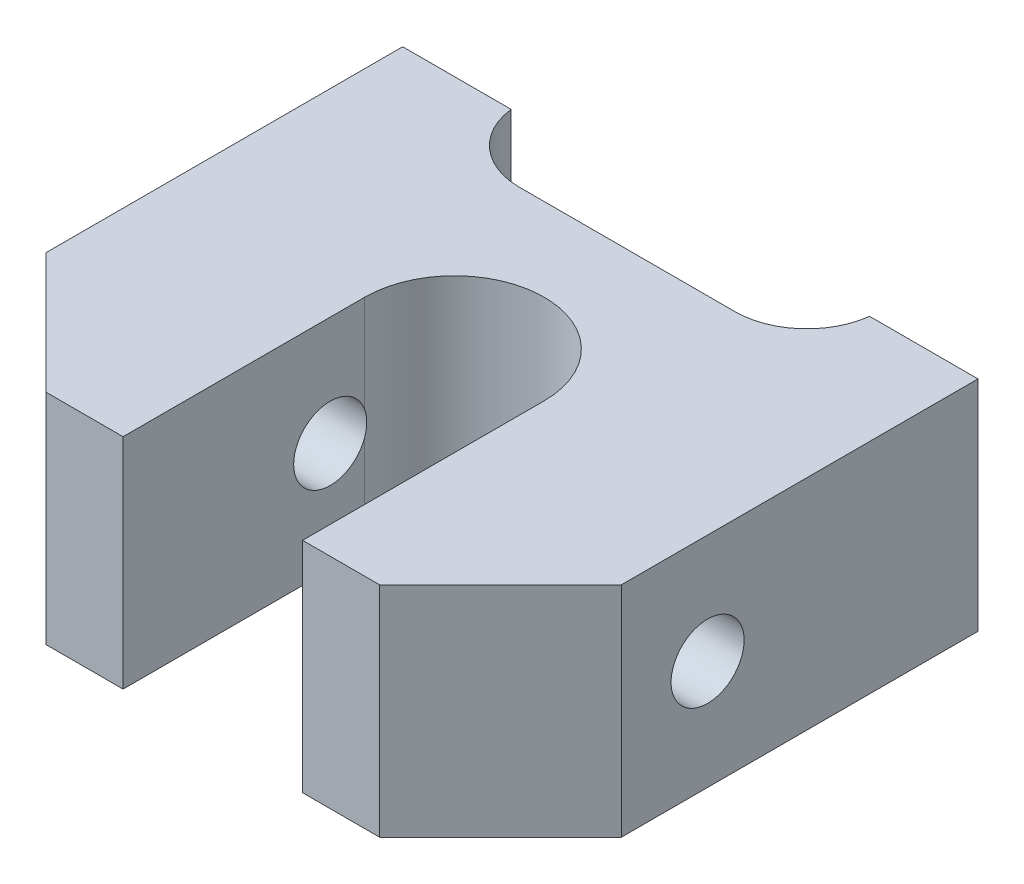
ISO-10303-21;
HEADER;
FILE_DESCRIPTION(('STEP AP214'),'2;1');
FILE_NAME('part.step','',(''),(''),'','','');
FILE_SCHEMA(('AUTOMOTIVE_DESIGN { 1 0 10303 214 1 1 1 1 }'));
ENDSEC;
DATA;
#1=APPLICATION_CONTEXT('core data for automotive mechanical design processes');
#2=APPLICATION_PROTOCOL_DEFINITION('international standard','automotive_design',2000,#1);
#3=PRODUCT_CONTEXT('',#1,'mechanical');
#4=PRODUCT('Part','Part','',(#3));
#5=PRODUCT_RELATED_PRODUCT_CATEGORY('part','',(#4));
#6=PRODUCT_DEFINITION_FORMATION('','',#4);
#7=PRODUCT_DEFINITION_CONTEXT('part definition',#1,'design');
#8=PRODUCT_DEFINITION('design','',#6,#7);
#9=PRODUCT_DEFINITION_SHAPE('','',#8);
#10=(LENGTH_UNIT() NAMED_UNIT(*) SI_UNIT(.MILLI.,.METRE.));
#11=(NAMED_UNIT(*) PLANE_ANGLE_UNIT() SI_UNIT($,.RADIAN.));
#12=(NAMED_UNIT(*) SI_UNIT($,.STERADIAN.) SOLID_ANGLE_UNIT());
#13=UNCERTAINTY_MEASURE_WITH_UNIT(LENGTH_MEASURE(1.E-05),#10,'distance_accuracy_value','');
#14=(GEOMETRIC_REPRESENTATION_CONTEXT(3) GLOBAL_UNCERTAINTY_ASSIGNED_CONTEXT((#13)) GLOBAL_UNIT_ASSIGNED_CONTEXT((#10,
#11,#12)) REPRESENTATION_CONTEXT('',''));
#15=CARTESIAN_POINT('',(0.,0.,0.));
#16=DIRECTION('',(0.,0.,1.));
#17=DIRECTION('',(1.,0.,0.));
#18=AXIS2_PLACEMENT_3D('',#15,#16,#17);
#19=CARTESIAN_POINT('',(34.3914499258173,-4.826,1.397));
#20=DIRECTION('',(1.,0.,0.));
#21=DIRECTION('',(0.,0.,-1.));
#22=AXIS2_PLACEMENT_3D('',#19,#20,#21);
#23=CYLINDRICAL_SURFACE('',#22,1.6129);
#24=CARTESIAN_POINT('',(3.96240000000001,-5.3540818213118,-0.127000000000003));
#25=CARTESIAN_POINT('',(3.96239606872544,-5.31062926964589,-0.142057415175625));
#26=CARTESIAN_POINT('',(3.96231466852501,-5.26655138224218,-0.155247680248759));
#27=CARTESIAN_POINT('',(3.9620908942501,-5.17743372511795,-0.177818873185899));
#28=CARTESIAN_POINT('',(3.96194852373047,-5.13239401162195,-0.187200023077449));
#29=CARTESIAN_POINT('',(3.96157795553437,-4.99881392418985,-0.209100450831656));
#30=CARTESIAN_POINT('',(3.96139554733492,-4.90933154980217,-0.21622711451484));
#31=CARTESIAN_POINT('',(3.96141000916451,-4.7324132038705,-0.215557179312041));
#32=CARTESIAN_POINT('',(3.96159857416771,-4.64497577305173,-0.208087378660905));
#33=CARTESIAN_POINT('',(3.96196423721747,-4.51447114546186,-0.186167779431552));
#34=CARTESIAN_POINT('',(3.96210239578767,-4.47048626860336,-0.176872451525207));
#35=CARTESIAN_POINT('',(3.96231846253592,-4.38344081623891,-0.154645947399195));
#36=CARTESIAN_POINT('',(3.96239636558582,-4.34038031970714,-0.141714461845504));
#37=CARTESIAN_POINT('',(3.96240000000001,-4.2979181786882,-0.127000000000005));
#38=B_SPLINE_CURVE_WITH_KNOTS('',3,(#24,#25,#26,#27,#28,#29,#30,#31,#32,#33,#34,#35,#36,#37),
.UNSPECIFIED.,.F.,.F.,(4,2,2,2,2,2,4),(0.,0.137879884792329,0.275751731621238,0.543728487271669,
0.805774245454699,0.940505245515592,1.07524771083797),.UNSPECIFIED.);
#39=CARTESIAN_POINT('',(3.96240000000001,-5.3540818213118,-0.127000000000003));
#40=VERTEX_POINT('',#39);
#41=CARTESIAN_POINT('',(3.96240000000001,-4.2979181786882,-0.127000000000004));
#42=VERTEX_POINT('',#41);
#43=EDGE_CURVE('E21',#40,#42,#38,.T.);
#44=ORIENTED_EDGE('',*,*,#43,.F.);
#45=CARTESIAN_POINT('',(3.9624,-4.826,1.397));
#46=DIRECTION('',(1.,0.,0.));
#47=DIRECTION('',(0.,0.,-1.));
#48=AXIS2_PLACEMENT_3D('',#45,#46,#47);
#49=CIRCLE('',#48,1.6129);
#50=EDGE_CURVE('E104',#42,#40,#49,.T.);
#51=ORIENTED_EDGE('',*,*,#50,.F.);
#52=EDGE_LOOP('',(#44,#51));
#53=FACE_BOUND('',#52,.T.);
#54=CARTESIAN_POINT('',(12.7,-4.826,1.397));
#55=DIRECTION('',(1.,0.,0.));
#56=DIRECTION('',(0.,0.,-1.));
#57=AXIS2_PLACEMENT_3D('',#54,#55,#56);
#58=CIRCLE('',#57,1.6129);
#59=CARTESIAN_POINT('',(12.7,-4.826,-0.2159));
#60=VERTEX_POINT('',#59);
#61=EDGE_CURVE('E155',#60,#60,#58,.T.);
#62=ORIENTED_EDGE('',*,*,#61,.T.);
#63=EDGE_LOOP('',(#62));
#64=FACE_BOUND('',#63,.T.);
#65=ADVANCED_FACE('F17',(#53,#64),#23,.F.);
#66=CARTESIAN_POINT('',(-34.3914499258173,-4.826,1.397));
#67=DIRECTION('',(-1.,0.,0.));
#68=DIRECTION('',(0.,0.,1.));
#69=AXIS2_PLACEMENT_3D('',#66,#67,#68);
#70=CYLINDRICAL_SURFACE('',#69,1.6129);
#71=CARTESIAN_POINT('',(-3.9624,-4.826,1.397));
#72=DIRECTION('',(-1.,0.,0.));
#73=DIRECTION('',(0.,0.,1.));
#74=AXIS2_PLACEMENT_3D('',#71,#72,#73);
#75=CIRCLE('',#74,1.6129);
#76=CARTESIAN_POINT('',(-3.9624,-5.3540818213118,-0.127000000000004));
#77=VERTEX_POINT('',#76);
#78=CARTESIAN_POINT('',(-3.9624,-4.2979181786882,-0.127000000000004));
#79=VERTEX_POINT('',#78);
#80=EDGE_CURVE('E224',#77,#79,#75,.T.);
#81=ORIENTED_EDGE('',*,*,#80,.F.);
#82=CARTESIAN_POINT('',(-3.96239999999999,-5.3540818213118,-0.127000000000003));
#83=CARTESIAN_POINT('',(-3.96239606872543,-5.31062926964589,-0.142057415175625));
#84=CARTESIAN_POINT('',(-3.962314668525,-5.26655138224217,-0.155247680248759));
#85=CARTESIAN_POINT('',(-3.96209089425008,-5.17743372511795,-0.177818873185899));
#86=CARTESIAN_POINT('',(-3.96194852373046,-5.13239401162195,-0.18720002307745));
#87=CARTESIAN_POINT('',(-3.96157795553436,-4.99881392418985,-0.209100450831656));
#88=CARTESIAN_POINT('',(-3.96139554733491,-4.90933154980217,-0.21622711451484));
#89=CARTESIAN_POINT('',(-3.9614100091645,-4.7324132038705,-0.215557179312041));
#90=CARTESIAN_POINT('',(-3.96159857416769,-4.64497577305173,-0.208087378660905));
#91=CARTESIAN_POINT('',(-3.96196423721745,-4.51447114546186,-0.186167779431552));
#92=CARTESIAN_POINT('',(-3.96210239578765,-4.47048626860336,-0.176872451525207));
#93=CARTESIAN_POINT('',(-3.9623184625359,-4.38344081623891,-0.154645947399195));
#94=CARTESIAN_POINT('',(-3.96239636558581,-4.34038031970714,-0.141714461845504));
#95=CARTESIAN_POINT('',(-3.96239999999999,-4.2979181786882,-0.127000000000005));
#96=B_SPLINE_CURVE_WITH_KNOTS('',3,(#82,#83,#84,#85,#86,#87,#88,#89,#90,#91,#92,#93,#94,#95),
.UNSPECIFIED.,.F.,.F.,(4,2,2,2,2,2,4),(0.,0.137879884792328,0.275751731621238,0.543728487271668,
0.805774245454698,0.940505245515591,1.07524771083797),.UNSPECIFIED.);
#97=EDGE_CURVE('E117',#77,#79,#96,.T.);
#98=ORIENTED_EDGE('',*,*,#97,.T.);
#99=EDGE_LOOP('',(#81,#98));
#100=FACE_BOUND('',#99,.T.);
#101=CARTESIAN_POINT('',(-12.7,-4.826,1.397));
#102=DIRECTION('',(-1.,0.,0.));
#103=DIRECTION('',(0.,0.,1.));
#104=AXIS2_PLACEMENT_3D('',#101,#102,#103);
#105=CIRCLE('',#104,1.6129);
#106=CARTESIAN_POINT('',(-12.7,-4.826,3.0099));
#107=VERTEX_POINT('',#106);
#108=EDGE_CURVE('E173',#107,#107,#105,.T.);
#109=ORIENTED_EDGE('',*,*,#108,.T.);
#110=EDGE_LOOP('',(#109));
#111=FACE_BOUND('',#110,.T.);
#112=ADVANCED_FACE('F230',(#100,#111),#70,.F.);
#113=CARTESIAN_POINT('',(-12.7,0.,-10.541));
#114=DIRECTION('',(0.,-1.,0.));
#115=DIRECTION('',(0.,0.,-1.));
#116=AXIS2_PLACEMENT_3D('',#113,#114,#115);
#117=PLANE('',#116);
#118=DIRECTION('',(-0.707106781186548,0.,0.707106781186547));
#119=VECTOR('',#118,1.);
#120=CARTESIAN_POINT('',(7.366,0.,10.541));
#121=LINE('',#120,#119);
#122=CARTESIAN_POINT('',(7.366,0.,10.541));
#123=VERTEX_POINT('',#122);
#124=CARTESIAN_POINT('',(12.7,0.,5.207));
#125=VERTEX_POINT('',#124);
#126=EDGE_CURVE('E145',#123,#125,#121,.F.);
#127=ORIENTED_EDGE('',*,*,#126,.T.);
#128=DIRECTION('',(0.,0.,1.));
#129=VECTOR('',#128,1.);
#130=CARTESIAN_POINT('',(12.7,0.,-10.541));
#131=LINE('',#130,#129);
#132=CARTESIAN_POINT('',(12.7,0.,-10.541));
#133=VERTEX_POINT('',#132);
#134=EDGE_CURVE('E103',#125,#133,#131,.F.);
#135=ORIENTED_EDGE('',*,*,#134,.T.);
#136=DIRECTION('',(1.,0.,0.));
#137=VECTOR('',#136,1.);
#138=CARTESIAN_POINT('',(-12.7,0.,-10.541));
#139=LINE('',#138,#137);
#140=CARTESIAN_POINT('',(7.91455710608167,0.,-10.541));
#141=VERTEX_POINT('',#140);
#142=EDGE_CURVE('E148',#133,#141,#139,.F.);
#143=ORIENTED_EDGE('',*,*,#142,.T.);
#144=CARTESIAN_POINT('',(4.7625,0.,-10.922));
#145=DIRECTION('',(0.,1.,0.));
#146=DIRECTION('',(0.,0.,1.));
#147=AXIS2_PLACEMENT_3D('',#144,#145,#146);
#148=CIRCLE('',#147,3.175);
#149=CARTESIAN_POINT('',(4.7625,0.,-7.747));
#150=VERTEX_POINT('',#149);
#151=EDGE_CURVE('E217',#141,#150,#148,.F.);
#152=ORIENTED_EDGE('',*,*,#151,.T.);
#153=DIRECTION('',(-1.,0.,0.));
#154=VECTOR('',#153,1.);
#155=CARTESIAN_POINT('',(-4.7625,0.,-7.747));
#156=LINE('',#155,#154);
#157=CARTESIAN_POINT('',(-4.7625,0.,-7.747));
#158=VERTEX_POINT('',#157);
#159=EDGE_CURVE('E158',#158,#150,#156,.F.);
#160=ORIENTED_EDGE('',*,*,#159,.F.);
#161=CARTESIAN_POINT('',(-4.7625,0.,-10.922));
#162=DIRECTION('',(0.,1.,0.));
#163=DIRECTION('',(0.,0.,1.));
#164=AXIS2_PLACEMENT_3D('',#161,#162,#163);
#165=CIRCLE('',#164,3.175);
#166=CARTESIAN_POINT('',(-7.91455710608168,0.,-10.541));
#167=VERTEX_POINT('',#166);
#168=EDGE_CURVE('E220',#158,#167,#165,.F.);
#169=ORIENTED_EDGE('',*,*,#168,.T.);
#170=DIRECTION('',(1.,0.,0.));
#171=VECTOR('',#170,1.);
#172=CARTESIAN_POINT('',(-12.7,0.,-10.541));
#173=LINE('',#172,#171);
#174=CARTESIAN_POINT('',(-12.7,0.,-10.541));
#175=VERTEX_POINT('',#174);
#176=EDGE_CURVE('E163',#167,#175,#173,.F.);
#177=ORIENTED_EDGE('',*,*,#176,.T.);
#178=DIRECTION('',(0.,0.,-1.));
#179=VECTOR('',#178,1.);
#180=CARTESIAN_POINT('',(-12.7,0.,10.541));
#181=LINE('',#180,#179);
#182=CARTESIAN_POINT('',(-12.7,0.,5.207));
#183=VERTEX_POINT('',#182);
#184=EDGE_CURVE('E170',#175,#183,#181,.F.);
#185=ORIENTED_EDGE('',*,*,#184,.T.);
#186=DIRECTION('',(-0.707106781186548,0.,-0.707106781186548));
#187=VECTOR('',#186,1.);
#188=CARTESIAN_POINT('',(-12.7,0.,5.207));
#189=LINE('',#188,#187);
#190=CARTESIAN_POINT('',(-7.366,0.,10.541));
#191=VERTEX_POINT('',#190);
#192=EDGE_CURVE('E176',#183,#191,#189,.F.);
#193=ORIENTED_EDGE('',*,*,#192,.T.);
#194=DIRECTION('',(-1.,0.,0.));
#195=VECTOR('',#194,1.);
#196=CARTESIAN_POINT('',(12.7,0.,10.541));
#197=LINE('',#196,#195);
#198=CARTESIAN_POINT('',(-3.9624,0.,10.541));
#199=VERTEX_POINT('',#198);
#200=EDGE_CURVE('E180',#191,#199,#197,.F.);
#201=ORIENTED_EDGE('',*,*,#200,.T.);
#202=DIRECTION('',(0.,0.,-1.));
#203=VECTOR('',#202,1.);
#204=CARTESIAN_POINT('',(-3.9624,0.,-0.127000000000004));
#205=LINE('',#204,#203);
#206=CARTESIAN_POINT('',(-3.9624,0.,-0.127000000000004));
#207=VERTEX_POINT('',#206);
#208=EDGE_CURVE('E188',#207,#199,#205,.F.);
#209=ORIENTED_EDGE('',*,*,#208,.F.);
#210=CARTESIAN_POINT('',(0.,0.,-0.127000000000004));
#211=DIRECTION('',(0.,1.,0.));
#212=DIRECTION('',(0.,0.,1.));
#213=AXIS2_PLACEMENT_3D('',#210,#211,#212);
#214=CIRCLE('',#213,3.9624);
#215=CARTESIAN_POINT('',(3.9624,0.,-0.127000000000004));
#216=VERTEX_POINT('',#215);
#217=EDGE_CURVE('E115',#207,#216,#214,.F.);
#218=ORIENTED_EDGE('',*,*,#217,.T.);
#219=DIRECTION('',(0.,0.,1.));
#220=VECTOR('',#219,1.);
#221=CARTESIAN_POINT('',(3.9624,0.,-0.127000000000004));
#222=LINE('',#221,#220);
#223=CARTESIAN_POINT('',(3.9624,0.,10.541));
#224=VERTEX_POINT('',#223);
#225=EDGE_CURVE('E114',#224,#216,#222,.F.);
#226=ORIENTED_EDGE('',*,*,#225,.F.);
#227=DIRECTION('',(-1.,0.,0.));
#228=VECTOR('',#227,1.);
#229=CARTESIAN_POINT('',(12.7,0.,10.541));
#230=LINE('',#229,#228);
#231=EDGE_CURVE('E134',#224,#123,#230,.F.);
#232=ORIENTED_EDGE('',*,*,#231,.T.);
#233=EDGE_LOOP('',(#127,#135,#143,#152,#160,#169,#177,#185,#193,#201,#209,#218,#226,#232));
#234=FACE_BOUND('',#233,.T.);
#235=ADVANCED_FACE('F252',(#234),#117,.F.);
#236=CARTESIAN_POINT('',(12.7,-9.652,-10.541));
#237=DIRECTION('',(-1.,0.,0.));
#238=DIRECTION('',(0.,0.,1.));
#239=AXIS2_PLACEMENT_3D('',#236,#237,#238);
#240=PLANE('',#239);
#241=ORIENTED_EDGE('',*,*,#61,.F.);
#242=EDGE_LOOP('',(#241));
#243=FACE_BOUND('',#242,.T.);
#244=DIRECTION('',(0.,1.,0.));
#245=VECTOR('',#244,1.);
#246=CARTESIAN_POINT('',(12.7,-9.652,5.207));
#247=LINE('',#246,#245);
#248=CARTESIAN_POINT('',(12.7,-9.652,5.207));
#249=VERTEX_POINT('',#248);
#250=EDGE_CURVE('E142',#125,#249,#247,.F.);
#251=ORIENTED_EDGE('',*,*,#250,.T.);
#252=DIRECTION('',(0.,0.,-1.));
#253=VECTOR('',#252,1.);
#254=CARTESIAN_POINT('',(12.7,-9.652,-10.541));
#255=LINE('',#254,#253);
#256=CARTESIAN_POINT('',(12.7,-9.652,-10.541));
#257=VERTEX_POINT('',#256);
#258=EDGE_CURVE('E139',#257,#249,#255,.F.);
#259=ORIENTED_EDGE('',*,*,#258,.F.);
#260=DIRECTION('',(0.,1.,0.));
#261=VECTOR('',#260,1.);
#262=CARTESIAN_POINT('',(12.7,-9.652,-10.541));
#263=LINE('',#262,#261);
#264=EDGE_CURVE('E150',#257,#133,#263,.T.);
#265=ORIENTED_EDGE('',*,*,#264,.T.);
#266=ORIENTED_EDGE('',*,*,#134,.F.);
#267=EDGE_LOOP('',(#251,#259,#265,#266));
#268=FACE_BOUND('',#267,.T.);
#269=ADVANCED_FACE('F249',(#243,#268),#240,.F.);
#270=CARTESIAN_POINT('',(7.366,-9.652,10.541));
#271=DIRECTION('',(-0.707106781186547,0.,-0.707106781186548));
#272=DIRECTION('',(-0.707106781186548,0.,0.707106781186547));
#273=AXIS2_PLACEMENT_3D('',#270,#271,#272);
#274=PLANE('',#273);
#275=ORIENTED_EDGE('',*,*,#250,.F.);
#276=ORIENTED_EDGE('',*,*,#126,.F.);
#277=DIRECTION('',(0.,1.,0.));
#278=VECTOR('',#277,1.);
#279=CARTESIAN_POINT('',(7.366,-9.652,10.541));
#280=LINE('',#279,#278);
#281=CARTESIAN_POINT('',(7.366,-9.652,10.541));
#282=VERTEX_POINT('',#281);
#283=EDGE_CURVE('E108',#123,#282,#280,.F.);
#284=ORIENTED_EDGE('',*,*,#283,.T.);
#285=DIRECTION('',(-0.707106781186547,0.,0.707106781186548));
#286=VECTOR('',#285,1.);
#287=CARTESIAN_POINT('',(12.7,-9.652,5.207));
#288=LINE('',#287,#286);
#289=EDGE_CURVE('E129',#249,#282,#288,.T.);
#290=ORIENTED_EDGE('',*,*,#289,.F.);
#291=EDGE_LOOP('',(#275,#276,#284,#290));
#292=FACE_BOUND('',#291,.T.);
#293=ADVANCED_FACE('F245',(#292),#274,.F.);
#294=CARTESIAN_POINT('',(12.7,-9.652,10.541));
#295=DIRECTION('',(0.,0.,-1.));
#296=DIRECTION('',(-1.,0.,0.));
#297=AXIS2_PLACEMENT_3D('',#294,#295,#296);
#298=PLANE('',#297);
#299=ORIENTED_EDGE('',*,*,#283,.F.);
#300=ORIENTED_EDGE('',*,*,#231,.F.);
#301=DIRECTION('',(0.,1.,0.));
#302=VECTOR('',#301,1.);
#303=CARTESIAN_POINT('',(3.9624,101.473,10.541));
#304=LINE('',#303,#302);
#305=CARTESIAN_POINT('',(3.9624,-9.652,10.541));
#306=VERTEX_POINT('',#305);
#307=EDGE_CURVE('E107',#306,#224,#304,.T.);
#308=ORIENTED_EDGE('',*,*,#307,.F.);
#309=DIRECTION('',(1.,0.,0.));
#310=VECTOR('',#309,1.);
#311=CARTESIAN_POINT('',(-12.7,-9.652,10.541));
#312=LINE('',#311,#310);
#313=EDGE_CURVE('E125',#282,#306,#312,.F.);
#314=ORIENTED_EDGE('',*,*,#313,.F.);
#315=EDGE_LOOP('',(#299,#300,#308,#314));
#316=FACE_BOUND('',#315,.T.);
#317=ADVANCED_FACE('F242',(#316),#298,.F.);
#318=CARTESIAN_POINT('',(3.9624,101.473,-0.127000000000004));
#319=DIRECTION('',(-1.,0.,0.));
#320=DIRECTION('',(0.,0.,1.));
#321=AXIS2_PLACEMENT_3D('',#318,#319,#320);
#322=PLANE('',#321);
#323=ORIENTED_EDGE('',*,*,#307,.T.);
#324=ORIENTED_EDGE('',*,*,#225,.T.);
#325=DIRECTION('',(0.,1.,0.));
#326=VECTOR('',#325,1.);
#327=CARTESIAN_POINT('',(3.96240000000001,101.473,-0.127000000000004));
#328=LINE('',#327,#326);
#329=EDGE_CURVE('E100',#216,#42,#328,.F.);
#330=ORIENTED_EDGE('',*,*,#329,.T.);
#331=ORIENTED_EDGE('',*,*,#50,.T.);
#332=DIRECTION('',(0.,1.,0.));
#333=VECTOR('',#332,1.);
#334=CARTESIAN_POINT('',(3.96240000000001,101.473,-0.127000000000004));
#335=LINE('',#334,#333);
#336=CARTESIAN_POINT('',(3.96240000000001,-9.65199999999999,-0.127000000000004));
#337=VERTEX_POINT('',#336);
#338=EDGE_CURVE('E102',#40,#337,#335,.F.);
#339=ORIENTED_EDGE('',*,*,#338,.T.);
#340=DIRECTION('',(0.,0.,-1.));
#341=VECTOR('',#340,1.);
#342=CARTESIAN_POINT('',(3.9624,-9.652,-10.541));
#343=LINE('',#342,#341);
#344=EDGE_CURVE('E128',#306,#337,#343,.T.);
#345=ORIENTED_EDGE('',*,*,#344,.F.);
#346=EDGE_LOOP('',(#323,#324,#330,#331,#339,#345));
#347=FACE_BOUND('',#346,.T.);
#348=ADVANCED_FACE('F112',(#347),#322,.T.);
#349=CARTESIAN_POINT('',(0.,101.473,-0.127000000000004));
#350=DIRECTION('',(0.,1.,0.));
#351=DIRECTION('',(0.,0.,1.));
#352=AXIS2_PLACEMENT_3D('',#349,#350,#351);
#353=CYLINDRICAL_SURFACE('',#352,3.9624);
#354=DIRECTION('',(0.,1.,0.));
#355=VECTOR('',#354,1.);
#356=CARTESIAN_POINT('',(-3.9624,101.473,-0.127000000000004));
#357=LINE('',#356,#355);
#358=CARTESIAN_POINT('',(-3.9624,-9.652,-0.127000000000004));
#359=VERTEX_POINT('',#358);
#360=EDGE_CURVE('E191',#359,#77,#357,.T.);
#361=ORIENTED_EDGE('',*,*,#360,.F.);
#362=CARTESIAN_POINT('',(0.,-9.65199999999999,-0.127000000000004));
#363=DIRECTION('',(0.,1.,0.));
#364=DIRECTION('',(0.,0.,1.));
#365=AXIS2_PLACEMENT_3D('',#362,#363,#364);
#366=CIRCLE('',#365,3.9624);
#367=EDGE_CURVE('E213',#337,#359,#366,.T.);
#368=ORIENTED_EDGE('',*,*,#367,.F.);
#369=ORIENTED_EDGE('',*,*,#338,.F.);
#370=ORIENTED_EDGE('',*,*,#43,.T.);
#371=ORIENTED_EDGE('',*,*,#329,.F.);
#372=ORIENTED_EDGE('',*,*,#217,.F.);
#373=DIRECTION('',(0.,1.,0.));
#374=VECTOR('',#373,1.);
#375=CARTESIAN_POINT('',(-3.9624,101.473,-0.127000000000004));
#376=LINE('',#375,#374);
#377=EDGE_CURVE('E192',#79,#207,#376,.T.);
#378=ORIENTED_EDGE('',*,*,#377,.F.);
#379=ORIENTED_EDGE('',*,*,#97,.F.);
#380=EDGE_LOOP('',(#361,#368,#369,#370,#371,#372,#378,#379));
#381=FACE_BOUND('',#380,.T.);
#382=ADVANCED_FACE('F98',(#381),#353,.F.);
#383=CARTESIAN_POINT('',(-3.9624,101.473,-0.127000000000004));
#384=DIRECTION('',(1.,0.,0.));
#385=DIRECTION('',(0.,0.,-1.));
#386=AXIS2_PLACEMENT_3D('',#383,#384,#385);
#387=PLANE('',#386);
#388=DIRECTION('',(0.,0.,-1.));
#389=VECTOR('',#388,1.);
#390=CARTESIAN_POINT('',(-3.9624,-9.652,-10.541));
#391=LINE('',#390,#389);
#392=CARTESIAN_POINT('',(-3.9624,-9.652,10.541));
#393=VERTEX_POINT('',#392);
#394=EDGE_CURVE('E216',#359,#393,#391,.F.);
#395=ORIENTED_EDGE('',*,*,#394,.F.);
#396=ORIENTED_EDGE('',*,*,#360,.T.);
#397=ORIENTED_EDGE('',*,*,#80,.T.);
#398=ORIENTED_EDGE('',*,*,#377,.T.);
#399=ORIENTED_EDGE('',*,*,#208,.T.);
#400=DIRECTION('',(0.,1.,0.));
#401=VECTOR('',#400,1.);
#402=CARTESIAN_POINT('',(-3.9624,-9.652,10.541));
#403=LINE('',#402,#401);
#404=EDGE_CURVE('E185',#199,#393,#403,.F.);
#405=ORIENTED_EDGE('',*,*,#404,.T.);
#406=EDGE_LOOP('',(#395,#396,#397,#398,#399,#405));
#407=FACE_BOUND('',#406,.T.);
#408=ADVANCED_FACE('F237',(#407),#387,.T.);
#409=CARTESIAN_POINT('',(12.7,-9.652,10.541));
#410=DIRECTION('',(0.,0.,-1.));
#411=DIRECTION('',(-1.,0.,0.));
#412=AXIS2_PLACEMENT_3D('',#409,#410,#411);
#413=PLANE('',#412);
#414=DIRECTION('',(0.,1.,0.));
#415=VECTOR('',#414,1.);
#416=CARTESIAN_POINT('',(-7.366,-9.652,10.541));
#417=LINE('',#416,#415);
#418=CARTESIAN_POINT('',(-7.366,-9.652,10.541));
#419=VERTEX_POINT('',#418);
#420=EDGE_CURVE('E179',#191,#419,#417,.F.);
#421=ORIENTED_EDGE('',*,*,#420,.T.);
#422=DIRECTION('',(1.,0.,0.));
#423=VECTOR('',#422,1.);
#424=CARTESIAN_POINT('',(-12.7,-9.652,10.541));
#425=LINE('',#424,#423);
#426=EDGE_CURVE('E309',#393,#419,#425,.F.);
#427=ORIENTED_EDGE('',*,*,#426,.F.);
#428=ORIENTED_EDGE('',*,*,#404,.F.);
#429=ORIENTED_EDGE('',*,*,#200,.F.);
#430=EDGE_LOOP('',(#421,#427,#428,#429));
#431=FACE_BOUND('',#430,.T.);
#432=ADVANCED_FACE('F293',(#431),#413,.F.);
#433=CARTESIAN_POINT('',(-12.7,-9.652,5.207));
#434=DIRECTION('',(0.707106781186548,0.,-0.707106781186548));
#435=DIRECTION('',(-0.707106781186548,0.,-0.707106781186548));
#436=AXIS2_PLACEMENT_3D('',#433,#434,#435);
#437=PLANE('',#436);
#438=ORIENTED_EDGE('',*,*,#420,.F.);
#439=ORIENTED_EDGE('',*,*,#192,.F.);
#440=DIRECTION('',(0.,1.,0.));
#441=VECTOR('',#440,1.);
#442=CARTESIAN_POINT('',(-12.7,-9.652,5.207));
#443=LINE('',#442,#441);
#444=CARTESIAN_POINT('',(-12.7,-9.652,5.207));
#445=VERTEX_POINT('',#444);
#446=EDGE_CURVE('E167',#183,#445,#443,.F.);
#447=ORIENTED_EDGE('',*,*,#446,.T.);
#448=DIRECTION('',(-0.707106781186547,0.,-0.707106781186548));
#449=VECTOR('',#448,1.);
#450=CARTESIAN_POINT('',(-7.366,-9.652,10.541));
#451=LINE('',#450,#449);
#452=EDGE_CURVE('E318',#419,#445,#451,.T.);
#453=ORIENTED_EDGE('',*,*,#452,.F.);
#454=EDGE_LOOP('',(#438,#439,#447,#453));
#455=FACE_BOUND('',#454,.T.);
#456=ADVANCED_FACE('F290',(#455),#437,.F.);
#457=CARTESIAN_POINT('',(-12.7,-9.652,10.541));
#458=DIRECTION('',(1.,0.,0.));
#459=DIRECTION('',(0.,0.,-1.));
#460=AXIS2_PLACEMENT_3D('',#457,#458,#459);
#461=PLANE('',#460);
#462=ORIENTED_EDGE('',*,*,#446,.F.);
#463=ORIENTED_EDGE('',*,*,#184,.F.);
#464=DIRECTION('',(0.,1.,0.));
#465=VECTOR('',#464,1.);
#466=CARTESIAN_POINT('',(-12.7,-9.652,-10.541));
#467=LINE('',#466,#465);
#468=CARTESIAN_POINT('',(-12.7,-9.652,-10.541));
#469=VERTEX_POINT('',#468);
#470=EDGE_CURVE('E166',#175,#469,#467,.F.);
#471=ORIENTED_EDGE('',*,*,#470,.T.);
#472=DIRECTION('',(0.,0.,-1.));
#473=VECTOR('',#472,1.);
#474=CARTESIAN_POINT('',(-12.7,-9.652,-10.541));
#475=LINE('',#474,#473);
#476=EDGE_CURVE('E322',#445,#469,#475,.T.);
#477=ORIENTED_EDGE('',*,*,#476,.F.);
#478=EDGE_LOOP('',(#462,#463,#471,#477));
#479=FACE_BOUND('',#478,.T.);
#480=ORIENTED_EDGE('',*,*,#108,.F.);
#481=EDGE_LOOP('',(#480));
#482=FACE_BOUND('',#481,.T.);
#483=ADVANCED_FACE('F286',(#479,#482),#461,.F.);
#484=CARTESIAN_POINT('',(-12.7,-9.652,-10.541));
#485=DIRECTION('',(0.,0.,1.));
#486=DIRECTION('',(1.,0.,0.));
#487=AXIS2_PLACEMENT_3D('',#484,#485,#486);
#488=PLANE('',#487);
#489=DIRECTION('',(1.,0.,0.));
#490=VECTOR('',#489,1.);
#491=CARTESIAN_POINT('',(-12.7,-9.652,-10.541));
#492=LINE('',#491,#490);
#493=CARTESIAN_POINT('',(-7.91455710608168,-9.652,-10.541));
#494=VERTEX_POINT('',#493);
#495=EDGE_CURVE('E212',#469,#494,#492,.T.);
#496=ORIENTED_EDGE('',*,*,#495,.F.);
#497=ORIENTED_EDGE('',*,*,#470,.F.);
#498=ORIENTED_EDGE('',*,*,#176,.F.);
#499=DIRECTION('',(0.,1.,0.));
#500=VECTOR('',#499,1.);
#501=CARTESIAN_POINT('',(-7.91455710608168,47.498,-10.541));
#502=LINE('',#501,#500);
#503=EDGE_CURVE('E162',#167,#494,#502,.F.);
#504=ORIENTED_EDGE('',*,*,#503,.T.);
#505=EDGE_LOOP('',(#496,#497,#498,#504));
#506=FACE_BOUND('',#505,.T.);
#507=ADVANCED_FACE('F282',(#506),#488,.F.);
#508=CARTESIAN_POINT('',(-4.7625,47.498,-10.922));
#509=DIRECTION('',(0.,1.,0.));
#510=DIRECTION('',(0.,0.,1.));
#511=AXIS2_PLACEMENT_3D('',#508,#509,#510);
#512=CYLINDRICAL_SURFACE('',#511,3.175);
#513=ORIENTED_EDGE('',*,*,#168,.F.);
#514=DIRECTION('',(0.,1.,0.));
#515=VECTOR('',#514,1.);
#516=CARTESIAN_POINT('',(-4.7625,47.498,-7.747));
#517=LINE('',#516,#515);
#518=CARTESIAN_POINT('',(-4.7625,-9.652,-7.747));
#519=VERTEX_POINT('',#518);
#520=EDGE_CURVE('E161',#519,#158,#517,.T.);
#521=ORIENTED_EDGE('',*,*,#520,.F.);
#522=CARTESIAN_POINT('',(-4.7625,-9.652,-10.922));
#523=DIRECTION('',(0.,1.,0.));
#524=DIRECTION('',(0.,0.,1.));
#525=AXIS2_PLACEMENT_3D('',#522,#523,#524);
#526=CIRCLE('',#525,3.175);
#527=EDGE_CURVE('E209',#494,#519,#526,.T.);
#528=ORIENTED_EDGE('',*,*,#527,.F.);
#529=ORIENTED_EDGE('',*,*,#503,.F.);
#530=EDGE_LOOP('',(#513,#521,#528,#529));
#531=FACE_BOUND('',#530,.T.);
#532=ADVANCED_FACE('F278',(#531),#512,.F.);
#533=CARTESIAN_POINT('',(-4.7625,47.498,-7.747));
#534=DIRECTION('',(0.,0.,-1.));
#535=DIRECTION('',(-1.,0.,0.));
#536=AXIS2_PLACEMENT_3D('',#533,#534,#535);
#537=PLANE('',#536);
#538=DIRECTION('',(1.,0.,0.));
#539=VECTOR('',#538,1.);
#540=CARTESIAN_POINT('',(-12.7,-9.652,-7.747));
#541=LINE('',#540,#539);
#542=CARTESIAN_POINT('',(4.7625,-9.652,-7.747));
#543=VERTEX_POINT('',#542);
#544=EDGE_CURVE('E208',#519,#543,#541,.T.);
#545=ORIENTED_EDGE('',*,*,#544,.F.);
#546=ORIENTED_EDGE('',*,*,#520,.T.);
#547=ORIENTED_EDGE('',*,*,#159,.T.);
#548=DIRECTION('',(0.,1.,0.));
#549=VECTOR('',#548,1.);
#550=CARTESIAN_POINT('',(4.7625,47.498,-7.747));
#551=LINE('',#550,#549);
#552=EDGE_CURVE('E219',#150,#543,#551,.F.);
#553=ORIENTED_EDGE('',*,*,#552,.T.);
#554=EDGE_LOOP('',(#545,#546,#547,#553));
#555=FACE_BOUND('',#554,.T.);
#556=ADVANCED_FACE('F275',(#555),#537,.T.);
#557=CARTESIAN_POINT('',(4.7625,47.498,-10.922));
#558=DIRECTION('',(0.,1.,0.));
#559=DIRECTION('',(0.,0.,1.));
#560=AXIS2_PLACEMENT_3D('',#557,#558,#559);
#561=CYLINDRICAL_SURFACE('',#560,3.175);
#562=CARTESIAN_POINT('',(4.7625,-9.652,-10.922));
#563=DIRECTION('',(0.,1.,0.));
#564=DIRECTION('',(0.,0.,1.));
#565=AXIS2_PLACEMENT_3D('',#562,#563,#564);
#566=CIRCLE('',#565,3.175);
#567=CARTESIAN_POINT('',(7.91455710608167,-9.652,-10.541));
#568=VERTEX_POINT('',#567);
#569=EDGE_CURVE('E31',#543,#568,#566,.T.);
#570=ORIENTED_EDGE('',*,*,#569,.F.);
#571=ORIENTED_EDGE('',*,*,#552,.F.);
#572=ORIENTED_EDGE('',*,*,#151,.F.);
#573=DIRECTION('',(0.,1.,0.));
#574=VECTOR('',#573,1.);
#575=CARTESIAN_POINT('',(7.91455710608167,-9.652,-10.541));
#576=LINE('',#575,#574);
#577=EDGE_CURVE('E40',#141,#568,#576,.F.);
#578=ORIENTED_EDGE('',*,*,#577,.T.);
#579=EDGE_LOOP('',(#570,#571,#572,#578));
#580=FACE_BOUND('',#579,.T.);
#581=ADVANCED_FACE('F269',(#580),#561,.F.);
#582=CARTESIAN_POINT('',(-12.7,-9.652,-10.541));
#583=DIRECTION('',(0.,0.,1.));
#584=DIRECTION('',(1.,0.,0.));
#585=AXIS2_PLACEMENT_3D('',#582,#583,#584);
#586=PLANE('',#585);
#587=ORIENTED_EDGE('',*,*,#142,.F.);
#588=ORIENTED_EDGE('',*,*,#264,.F.);
#589=DIRECTION('',(1.,0.,0.));
#590=VECTOR('',#589,1.);
#591=CARTESIAN_POINT('',(-12.7,-9.652,-10.541));
#592=LINE('',#591,#590);
#593=EDGE_CURVE('E11',#568,#257,#592,.T.);
#594=ORIENTED_EDGE('',*,*,#593,.F.);
#595=ORIENTED_EDGE('',*,*,#577,.F.);
#596=EDGE_LOOP('',(#587,#588,#594,#595));
#597=FACE_BOUND('',#596,.T.);
#598=ADVANCED_FACE('F263',(#597),#586,.F.);
#599=CARTESIAN_POINT('',(-12.7,-9.652,-10.541));
#600=DIRECTION('',(0.,-1.,0.));
#601=DIRECTION('',(0.,0.,-1.));
#602=AXIS2_PLACEMENT_3D('',#599,#600,#601);
#603=PLANE('',#602);
#604=ORIENTED_EDGE('',*,*,#569,.T.);
#605=ORIENTED_EDGE('',*,*,#593,.T.);
#606=ORIENTED_EDGE('',*,*,#258,.T.);
#607=ORIENTED_EDGE('',*,*,#289,.T.);
#608=ORIENTED_EDGE('',*,*,#313,.T.);
#609=ORIENTED_EDGE('',*,*,#344,.T.);
#610=ORIENTED_EDGE('',*,*,#367,.T.);
#611=ORIENTED_EDGE('',*,*,#394,.T.);
#612=ORIENTED_EDGE('',*,*,#426,.T.);
#613=ORIENTED_EDGE('',*,*,#452,.T.);
#614=ORIENTED_EDGE('',*,*,#476,.T.);
#615=ORIENTED_EDGE('',*,*,#495,.T.);
#616=ORIENTED_EDGE('',*,*,#527,.T.);
#617=ORIENTED_EDGE('',*,*,#544,.T.);
#618=EDGE_LOOP('',(#604,#605,#606,#607,#608,#609,#610,#611,#612,#613,#614,#615,#616,#617));
#619=FACE_BOUND('',#618,.T.);
#620=ADVANCED_FACE('F261',(#619),#603,.T.);
#621=CLOSED_SHELL('',(#65,#112,#235,#269,#293,#317,#348,#382,#408,#432,#456,#483,#507,#532,#556,
#581,#598,#620));
#622=MANIFOLD_SOLID_BREP('B1',#621);
#623=ADVANCED_BREP_SHAPE_REPRESENTATION('',(#18,#622),#14);
#624=SHAPE_DEFINITION_REPRESENTATION(#9,#623);
ENDSEC;
END-ISO-10303-21;
